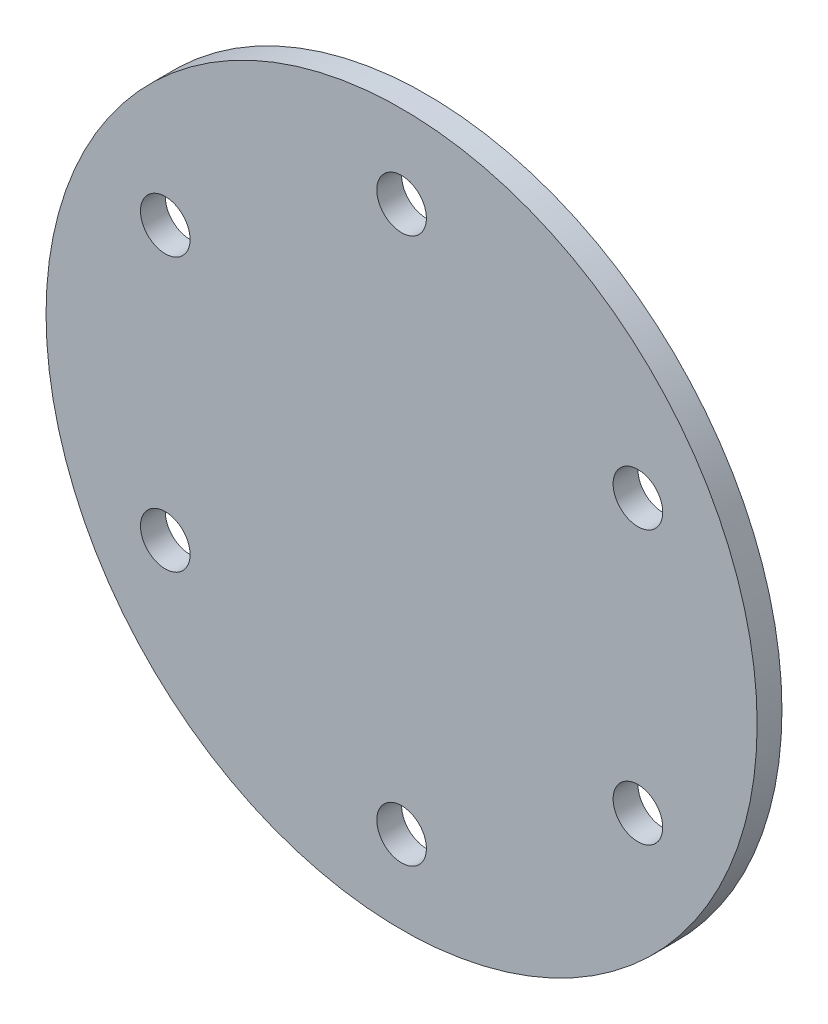
ISO-10303-21;
HEADER;
FILE_DESCRIPTION(('STEP AP214'),'2;1');
FILE_NAME('part.step','',(''),(''),'','','');
FILE_SCHEMA(('AUTOMOTIVE_DESIGN { 1 0 10303 214 1 1 1 1 }'));
ENDSEC;
DATA;
#1=APPLICATION_CONTEXT('core data for automotive mechanical design processes');
#2=APPLICATION_PROTOCOL_DEFINITION('international standard','automotive_design',2000,#1);
#3=PRODUCT_CONTEXT('',#1,'mechanical');
#4=PRODUCT('Part','Part','',(#3));
#5=PRODUCT_RELATED_PRODUCT_CATEGORY('part','',(#4));
#6=PRODUCT_DEFINITION_FORMATION('','',#4);
#7=PRODUCT_DEFINITION_CONTEXT('part definition',#1,'design');
#8=PRODUCT_DEFINITION('design','',#6,#7);
#9=PRODUCT_DEFINITION_SHAPE('','',#8);
#10=(LENGTH_UNIT() NAMED_UNIT(*) SI_UNIT(.MILLI.,.METRE.));
#11=(NAMED_UNIT(*) PLANE_ANGLE_UNIT() SI_UNIT($,.RADIAN.));
#12=(NAMED_UNIT(*) SI_UNIT($,.STERADIAN.) SOLID_ANGLE_UNIT());
#13=UNCERTAINTY_MEASURE_WITH_UNIT(LENGTH_MEASURE(1.E-05),#10,'distance_accuracy_value','');
#14=(GEOMETRIC_REPRESENTATION_CONTEXT(3) GLOBAL_UNCERTAINTY_ASSIGNED_CONTEXT((#13)) GLOBAL_UNIT_ASSIGNED_CONTEXT((#10,
#11,#12)) REPRESENTATION_CONTEXT('',''));
#15=CARTESIAN_POINT('',(0.,0.,0.));
#16=DIRECTION('',(0.,0.,1.));
#17=DIRECTION('',(1.,0.,0.));
#18=AXIS2_PLACEMENT_3D('',#15,#16,#17);
#19=CARTESIAN_POINT('',(0.,0.,3.));
#20=DIRECTION('',(0.,0.,-1.));
#21=DIRECTION('',(-1.,0.,0.));
#22=AXIS2_PLACEMENT_3D('',#19,#20,#21);
#23=CYLINDRICAL_SURFACE('',#22,43.);
#24=CARTESIAN_POINT('',(0.,0.,3.));
#25=DIRECTION('',(0.,0.,1.));
#26=DIRECTION('',(1.,0.,0.));
#27=AXIS2_PLACEMENT_3D('',#24,#25,#26);
#28=CIRCLE('',#27,43.);
#29=CARTESIAN_POINT('',(43.,0.,3.));
#30=VERTEX_POINT('',#29);
#31=EDGE_CURVE('E10',#30,#30,#28,.T.);
#32=ORIENTED_EDGE('',*,*,#31,.F.);
#33=EDGE_LOOP('',(#32));
#34=FACE_BOUND('',#33,.T.);
#35=CARTESIAN_POINT('',(0.,0.,0.));
#36=DIRECTION('',(0.,0.,1.));
#37=DIRECTION('',(1.,0.,0.));
#38=AXIS2_PLACEMENT_3D('',#35,#36,#37);
#39=CIRCLE('',#38,43.);
#40=CARTESIAN_POINT('',(43.,0.,0.));
#41=VERTEX_POINT('',#40);
#42=EDGE_CURVE('E36',#41,#41,#39,.T.);
#43=ORIENTED_EDGE('',*,*,#42,.T.);
#44=EDGE_LOOP('',(#43));
#45=FACE_BOUND('',#44,.T.);
#46=ADVANCED_FACE('F33',(#34,#45),#23,.T.);
#47=CARTESIAN_POINT('',(0.,0.,3.));
#48=DIRECTION('',(0.,0.,1.));
#49=DIRECTION('',(1.,0.,0.));
#50=AXIS2_PLACEMENT_3D('',#47,#48,#49);
#51=PLANE('',#50);
#52=CARTESIAN_POINT('',(28.5788383248863,16.5000000000003,3.));
#53=DIRECTION('',(0.,0.,1.));
#54=DIRECTION('',(0.50000000000001,-0.866025403784433,0.));
#55=AXIS2_PLACEMENT_3D('',#52,#53,#54);
#56=CIRCLE('',#55,3.);
#57=CARTESIAN_POINT('',(30.0788383248863,13.901923788647,3.));
#58=VERTEX_POINT('',#57);
#59=EDGE_CURVE('E60',#58,#58,#56,.T.);
#60=ORIENTED_EDGE('',*,*,#59,.F.);
#61=EDGE_LOOP('',(#60));
#62=FACE_BOUND('',#61,.T.);
#63=CARTESIAN_POINT('',(28.5788383248866,-16.4999999999997,3.));
#64=DIRECTION('',(0.,0.,1.));
#65=DIRECTION('',(-0.499999999999992,-0.866025403784443,0.));
#66=AXIS2_PLACEMENT_3D('',#63,#64,#65);
#67=CIRCLE('',#66,3.);
#68=CARTESIAN_POINT('',(27.0788383248867,-19.0980762113531,3.));
#69=VERTEX_POINT('',#68);
#70=EDGE_CURVE('E66',#69,#69,#67,.T.);
#71=ORIENTED_EDGE('',*,*,#70,.F.);
#72=EDGE_LOOP('',(#71));
#73=FACE_BOUND('',#72,.T.);
#74=CARTESIAN_POINT('',(0.,-33.,3.));
#75=DIRECTION('',(0.,0.,1.));
#76=DIRECTION('',(-1.,0.,0.));
#77=AXIS2_PLACEMENT_3D('',#74,#75,#76);
#78=CIRCLE('',#77,3.);
#79=CARTESIAN_POINT('',(-3.,-33.,3.));
#80=VERTEX_POINT('',#79);
#81=EDGE_CURVE('E72',#80,#80,#78,.T.);
#82=ORIENTED_EDGE('',*,*,#81,.F.);
#83=EDGE_LOOP('',(#82));
#84=FACE_BOUND('',#83,.T.);
#85=CARTESIAN_POINT('',(-28.5788383248864,-16.5000000000001,3.));
#86=DIRECTION('',(0.,0.,1.));
#87=DIRECTION('',(-0.500000000000004,0.866025403784436,0.));
#88=AXIS2_PLACEMENT_3D('',#85,#86,#87);
#89=CIRCLE('',#88,3.);
#90=CARTESIAN_POINT('',(-30.0788383248864,-13.9019237886468,3.));
#91=VERTEX_POINT('',#90);
#92=EDGE_CURVE('E54',#91,#91,#89,.T.);
#93=ORIENTED_EDGE('',*,*,#92,.F.);
#94=EDGE_LOOP('',(#93));
#95=FACE_BOUND('',#94,.T.);
#96=CARTESIAN_POINT('',(-28.5788383248865,16.4999999999999,3.));
#97=DIRECTION('',(0.,0.,1.));
#98=DIRECTION('',(0.499999999999998,0.86602540378444,0.));
#99=AXIS2_PLACEMENT_3D('',#96,#97,#98);
#100=CIRCLE('',#99,3.);
#101=CARTESIAN_POINT('',(-27.0788383248865,19.0980762113533,3.));
#102=VERTEX_POINT('',#101);
#103=EDGE_CURVE('E48',#102,#102,#100,.T.);
#104=ORIENTED_EDGE('',*,*,#103,.F.);
#105=EDGE_LOOP('',(#104));
#106=FACE_BOUND('',#105,.T.);
#107=CARTESIAN_POINT('',(0.,33.,3.));
#108=DIRECTION('',(0.,0.,1.));
#109=DIRECTION('',(1.,0.,0.));
#110=AXIS2_PLACEMENT_3D('',#107,#108,#109);
#111=CIRCLE('',#110,3.);
#112=CARTESIAN_POINT('',(3.,33.,3.));
#113=VERTEX_POINT('',#112);
#114=EDGE_CURVE('E43',#113,#113,#111,.T.);
#115=ORIENTED_EDGE('',*,*,#114,.F.);
#116=EDGE_LOOP('',(#115));
#117=FACE_BOUND('',#116,.T.);
#118=ORIENTED_EDGE('',*,*,#31,.T.);
#119=EDGE_LOOP('',(#118));
#120=FACE_BOUND('',#119,.T.);
#121=ADVANCED_FACE('F84',(#62,#73,#84,#95,#106,#117,#120),#51,.T.);
#122=CARTESIAN_POINT('',(0.,0.,0.));
#123=DIRECTION('',(0.,0.,1.));
#124=DIRECTION('',(1.,0.,0.));
#125=AXIS2_PLACEMENT_3D('',#122,#123,#124);
#126=PLANE('',#125);
#127=CARTESIAN_POINT('',(28.5788383248863,16.5000000000003,0.));
#128=DIRECTION('',(0.,0.,1.));
#129=DIRECTION('',(0.50000000000001,-0.866025403784433,0.));
#130=AXIS2_PLACEMENT_3D('',#127,#128,#129);
#131=CIRCLE('',#130,3.);
#132=CARTESIAN_POINT('',(30.0788383248863,13.901923788647,0.));
#133=VERTEX_POINT('',#132);
#134=EDGE_CURVE('E57',#133,#133,#131,.T.);
#135=ORIENTED_EDGE('',*,*,#134,.T.);
#136=EDGE_LOOP('',(#135));
#137=FACE_BOUND('',#136,.T.);
#138=CARTESIAN_POINT('',(28.5788383248866,-16.4999999999997,0.));
#139=DIRECTION('',(0.,0.,1.));
#140=DIRECTION('',(-0.499999999999992,-0.866025403784443,0.));
#141=AXIS2_PLACEMENT_3D('',#138,#139,#140);
#142=CIRCLE('',#141,3.);
#143=CARTESIAN_POINT('',(27.0788383248867,-19.0980762113531,0.));
#144=VERTEX_POINT('',#143);
#145=EDGE_CURVE('E63',#144,#144,#142,.T.);
#146=ORIENTED_EDGE('',*,*,#145,.T.);
#147=EDGE_LOOP('',(#146));
#148=FACE_BOUND('',#147,.T.);
#149=CARTESIAN_POINT('',(0.,-33.,0.));
#150=DIRECTION('',(0.,0.,1.));
#151=DIRECTION('',(-1.,0.,0.));
#152=AXIS2_PLACEMENT_3D('',#149,#150,#151);
#153=CIRCLE('',#152,3.);
#154=CARTESIAN_POINT('',(-3.,-33.,0.));
#155=VERTEX_POINT('',#154);
#156=EDGE_CURVE('E69',#155,#155,#153,.T.);
#157=ORIENTED_EDGE('',*,*,#156,.T.);
#158=EDGE_LOOP('',(#157));
#159=FACE_BOUND('',#158,.T.);
#160=CARTESIAN_POINT('',(-28.5788383248864,-16.5000000000001,0.));
#161=DIRECTION('',(0.,0.,1.));
#162=DIRECTION('',(-0.500000000000004,0.866025403784436,0.));
#163=AXIS2_PLACEMENT_3D('',#160,#161,#162);
#164=CIRCLE('',#163,3.);
#165=CARTESIAN_POINT('',(-30.0788383248864,-13.9019237886468,0.));
#166=VERTEX_POINT('',#165);
#167=EDGE_CURVE('E75',#166,#166,#164,.T.);
#168=ORIENTED_EDGE('',*,*,#167,.T.);
#169=EDGE_LOOP('',(#168));
#170=FACE_BOUND('',#169,.T.);
#171=CARTESIAN_POINT('',(-28.5788383248865,16.4999999999999,0.));
#172=DIRECTION('',(0.,0.,1.));
#173=DIRECTION('',(0.499999999999998,0.86602540378444,0.));
#174=AXIS2_PLACEMENT_3D('',#171,#172,#173);
#175=CIRCLE('',#174,3.);
#176=CARTESIAN_POINT('',(-27.0788383248865,19.0980762113533,0.));
#177=VERTEX_POINT('',#176);
#178=EDGE_CURVE('E51',#177,#177,#175,.T.);
#179=ORIENTED_EDGE('',*,*,#178,.T.);
#180=EDGE_LOOP('',(#179));
#181=FACE_BOUND('',#180,.T.);
#182=CARTESIAN_POINT('',(0.,33.,0.));
#183=DIRECTION('',(0.,0.,1.));
#184=DIRECTION('',(1.,0.,0.));
#185=AXIS2_PLACEMENT_3D('',#182,#183,#184);
#186=CIRCLE('',#185,3.);
#187=CARTESIAN_POINT('',(3.,33.,0.));
#188=VERTEX_POINT('',#187);
#189=EDGE_CURVE('E45',#188,#188,#186,.T.);
#190=ORIENTED_EDGE('',*,*,#189,.T.);
#191=EDGE_LOOP('',(#190));
#192=FACE_BOUND('',#191,.T.);
#193=ORIENTED_EDGE('',*,*,#42,.F.);
#194=EDGE_LOOP('',(#193));
#195=FACE_BOUND('',#194,.T.);
#196=ADVANCED_FACE('F87',(#137,#148,#159,#170,#181,#192,#195),#126,.F.);
#197=CARTESIAN_POINT('',(0.,33.,3.));
#198=DIRECTION('',(0.,0.,-1.));
#199=DIRECTION('',(-1.,0.,0.));
#200=AXIS2_PLACEMENT_3D('',#197,#198,#199);
#201=CYLINDRICAL_SURFACE('',#200,3.);
#202=ORIENTED_EDGE('',*,*,#114,.T.);
#203=EDGE_LOOP('',(#202));
#204=FACE_BOUND('',#203,.T.);
#205=ORIENTED_EDGE('',*,*,#189,.F.);
#206=EDGE_LOOP('',(#205));
#207=FACE_BOUND('',#206,.T.);
#208=ADVANCED_FACE('F94',(#204,#207),#201,.F.);
#209=CARTESIAN_POINT('',(-28.5788383248865,16.4999999999999,3.));
#210=DIRECTION('',(0.,0.,-1.));
#211=DIRECTION('',(-1.,0.,0.));
#212=AXIS2_PLACEMENT_3D('',#209,#210,#211);
#213=CYLINDRICAL_SURFACE('',#212,3.);
#214=ORIENTED_EDGE('',*,*,#103,.T.);
#215=EDGE_LOOP('',(#214));
#216=FACE_BOUND('',#215,.T.);
#217=ORIENTED_EDGE('',*,*,#178,.F.);
#218=EDGE_LOOP('',(#217));
#219=FACE_BOUND('',#218,.T.);
#220=ADVANCED_FACE('F97',(#216,#219),#213,.F.);
#221=CARTESIAN_POINT('',(-28.5788383248864,-16.5000000000001,3.));
#222=DIRECTION('',(0.,0.,-1.));
#223=DIRECTION('',(-1.,0.,0.));
#224=AXIS2_PLACEMENT_3D('',#221,#222,#223);
#225=CYLINDRICAL_SURFACE('',#224,3.);
#226=ORIENTED_EDGE('',*,*,#92,.T.);
#227=EDGE_LOOP('',(#226));
#228=FACE_BOUND('',#227,.T.);
#229=ORIENTED_EDGE('',*,*,#167,.F.);
#230=EDGE_LOOP('',(#229));
#231=FACE_BOUND('',#230,.T.);
#232=ADVANCED_FACE('F81',(#228,#231),#225,.F.);
#233=CARTESIAN_POINT('',(0.,-33.,3.));
#234=DIRECTION('',(0.,0.,-1.));
#235=DIRECTION('',(-1.,0.,0.));
#236=AXIS2_PLACEMENT_3D('',#233,#234,#235);
#237=CYLINDRICAL_SURFACE('',#236,3.);
#238=ORIENTED_EDGE('',*,*,#81,.T.);
#239=EDGE_LOOP('',(#238));
#240=FACE_BOUND('',#239,.T.);
#241=ORIENTED_EDGE('',*,*,#156,.F.);
#242=EDGE_LOOP('',(#241));
#243=FACE_BOUND('',#242,.T.);
#244=ADVANCED_FACE('F135',(#240,#243),#237,.F.);
#245=CARTESIAN_POINT('',(28.5788383248866,-16.4999999999997,3.));
#246=DIRECTION('',(0.,0.,-1.));
#247=DIRECTION('',(-1.,0.,0.));
#248=AXIS2_PLACEMENT_3D('',#245,#246,#247);
#249=CYLINDRICAL_SURFACE('',#248,3.);
#250=ORIENTED_EDGE('',*,*,#70,.T.);
#251=EDGE_LOOP('',(#250));
#252=FACE_BOUND('',#251,.T.);
#253=ORIENTED_EDGE('',*,*,#145,.F.);
#254=EDGE_LOOP('',(#253));
#255=FACE_BOUND('',#254,.T.);
#256=ADVANCED_FACE('F142',(#252,#255),#249,.F.);
#257=CARTESIAN_POINT('',(28.5788383248863,16.5000000000003,3.));
#258=DIRECTION('',(0.,0.,-1.));
#259=DIRECTION('',(-1.,0.,0.));
#260=AXIS2_PLACEMENT_3D('',#257,#258,#259);
#261=CYLINDRICAL_SURFACE('',#260,3.);
#262=ORIENTED_EDGE('',*,*,#59,.T.);
#263=EDGE_LOOP('',(#262));
#264=FACE_BOUND('',#263,.T.);
#265=ORIENTED_EDGE('',*,*,#134,.F.);
#266=EDGE_LOOP('',(#265));
#267=FACE_BOUND('',#266,.T.);
#268=ADVANCED_FACE('F150',(#264,#267),#261,.F.);
#269=CLOSED_SHELL('',(#46,#121,#196,#208,#220,#232,#244,#256,#268));
#270=MANIFOLD_SOLID_BREP('B2',#269);
#271=ADVANCED_BREP_SHAPE_REPRESENTATION('',(#18,#270),#14);
#272=SHAPE_DEFINITION_REPRESENTATION(#9,#271);
ENDSEC;
END-ISO-10303-21;
